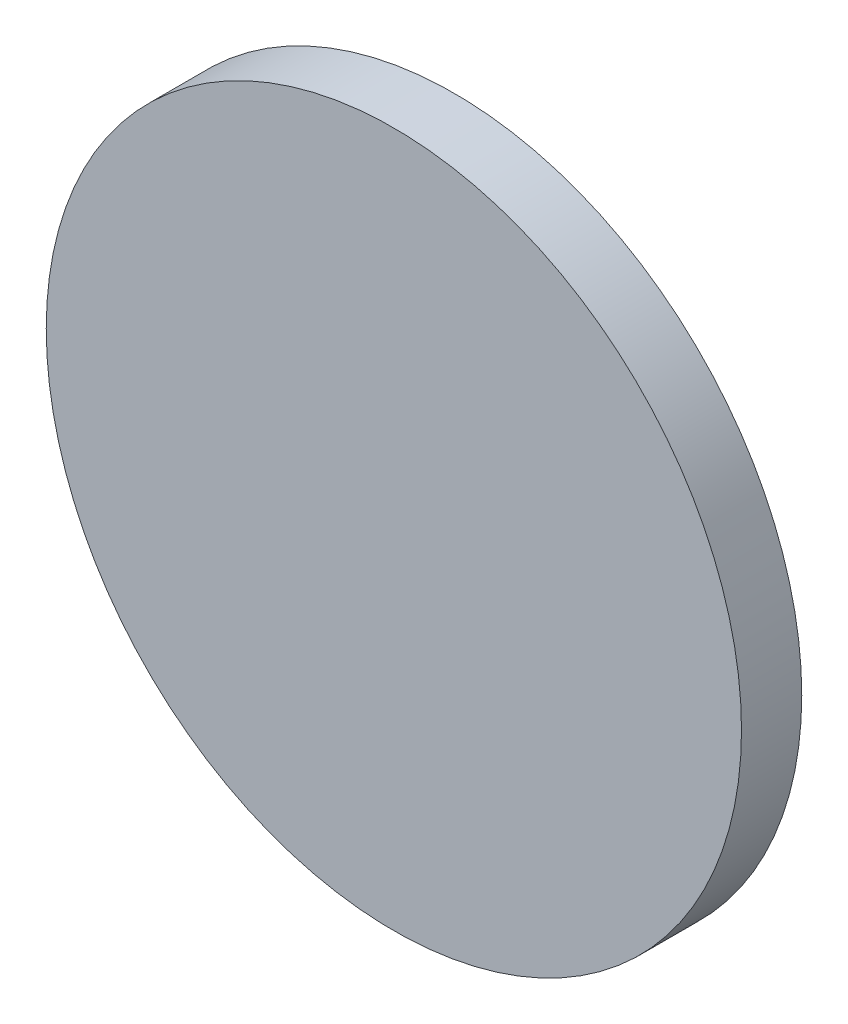
ISO-10303-21;
HEADER;
FILE_DESCRIPTION(('STEP AP214'),'2;1');
FILE_NAME('part.step','',(''),(''),'','','');
FILE_SCHEMA(('AUTOMOTIVE_DESIGN { 1 0 10303 214 1 1 1 1 }'));
ENDSEC;
DATA;
#1=APPLICATION_CONTEXT('core data for automotive mechanical design processes');
#2=APPLICATION_PROTOCOL_DEFINITION('international standard','automotive_design',2000,#1);
#3=PRODUCT_CONTEXT('',#1,'mechanical');
#4=PRODUCT('Part','Part','',(#3));
#5=PRODUCT_RELATED_PRODUCT_CATEGORY('part','',(#4));
#6=PRODUCT_DEFINITION_FORMATION('','',#4);
#7=PRODUCT_DEFINITION_CONTEXT('part definition',#1,'design');
#8=PRODUCT_DEFINITION('design','',#6,#7);
#9=PRODUCT_DEFINITION_SHAPE('','',#8);
#10=(LENGTH_UNIT() NAMED_UNIT(*) SI_UNIT(.MILLI.,.METRE.));
#11=(NAMED_UNIT(*) PLANE_ANGLE_UNIT() SI_UNIT($,.RADIAN.));
#12=(NAMED_UNIT(*) SI_UNIT($,.STERADIAN.) SOLID_ANGLE_UNIT());
#13=UNCERTAINTY_MEASURE_WITH_UNIT(LENGTH_MEASURE(1.E-05),#10,'distance_accuracy_value','');
#14=(GEOMETRIC_REPRESENTATION_CONTEXT(3) GLOBAL_UNCERTAINTY_ASSIGNED_CONTEXT((#13)) GLOBAL_UNIT_ASSIGNED_CONTEXT((#10,
#11,#12)) REPRESENTATION_CONTEXT('',''));
#15=CARTESIAN_POINT('',(0.,0.,0.));
#16=DIRECTION('',(0.,0.,1.));
#17=DIRECTION('',(1.,0.,0.));
#18=AXIS2_PLACEMENT_3D('',#15,#16,#17);
#19=CARTESIAN_POINT('',(0.,0.,13.));
#20=DIRECTION('',(0.,0.,-1.));
#21=DIRECTION('',(-1.,0.,0.));
#22=AXIS2_PLACEMENT_3D('',#19,#20,#21);
#23=CYLINDRICAL_SURFACE('',#22,75.);
#24=CARTESIAN_POINT('',(0.,0.,13.));
#25=DIRECTION('',(0.,0.,1.));
#26=DIRECTION('',(1.,0.,0.));
#27=AXIS2_PLACEMENT_3D('',#24,#25,#26);
#28=CIRCLE('',#27,75.);
#29=CARTESIAN_POINT('',(75.,0.,13.));
#30=VERTEX_POINT('',#29);
#31=EDGE_CURVE('E10',#30,#30,#28,.T.);
#32=ORIENTED_EDGE('',*,*,#31,.F.);
#33=EDGE_LOOP('',(#32));
#34=FACE_BOUND('',#33,.T.);
#35=CARTESIAN_POINT('',(0.,0.,0.));
#36=DIRECTION('',(0.,0.,1.));
#37=DIRECTION('',(1.,0.,0.));
#38=AXIS2_PLACEMENT_3D('',#35,#36,#37);
#39=CIRCLE('',#38,75.);
#40=CARTESIAN_POINT('',(75.,0.,0.));
#41=VERTEX_POINT('',#40);
#42=EDGE_CURVE('E36',#41,#41,#39,.T.);
#43=ORIENTED_EDGE('',*,*,#42,.T.);
#44=EDGE_LOOP('',(#43));
#45=FACE_BOUND('',#44,.T.);
#46=ADVANCED_FACE('F33',(#34,#45),#23,.T.);
#47=CARTESIAN_POINT('',(0.,0.,13.));
#48=DIRECTION('',(0.,0.,1.));
#49=DIRECTION('',(1.,0.,0.));
#50=AXIS2_PLACEMENT_3D('',#47,#48,#49);
#51=PLANE('',#50);
#52=ORIENTED_EDGE('',*,*,#31,.T.);
#53=EDGE_LOOP('',(#52));
#54=FACE_BOUND('',#53,.T.);
#55=ADVANCED_FACE('F48',(#54),#51,.T.);
#56=CARTESIAN_POINT('',(0.,0.,0.));
#57=DIRECTION('',(0.,0.,1.));
#58=DIRECTION('',(1.,0.,0.));
#59=AXIS2_PLACEMENT_3D('',#56,#57,#58);
#60=PLANE('',#59);
#61=ORIENTED_EDGE('',*,*,#42,.F.);
#62=EDGE_LOOP('',(#61));
#63=FACE_BOUND('',#62,.T.);
#64=ADVANCED_FACE('F46',(#63),#60,.F.);
#65=CLOSED_SHELL('',(#46,#55,#64));
#66=MANIFOLD_SOLID_BREP('B2',#65);
#67=ADVANCED_BREP_SHAPE_REPRESENTATION('',(#18,#66),#14);
#68=SHAPE_DEFINITION_REPRESENTATION(#9,#67);
ENDSEC;
END-ISO-10303-21;
